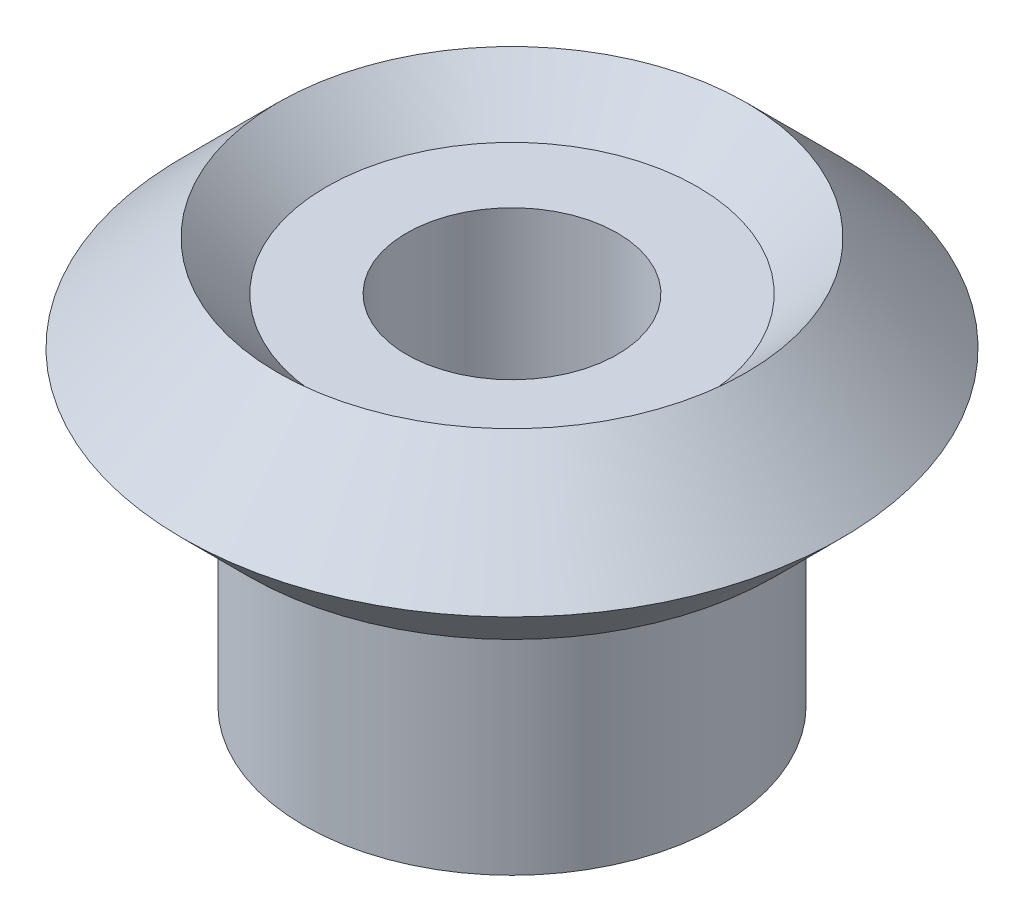
ISO-10303-21;
HEADER;
FILE_DESCRIPTION(('STEP AP214'),'2;1');
FILE_NAME('part.step','',(''),(''),'','','');
FILE_SCHEMA(('AUTOMOTIVE_DESIGN { 1 0 10303 214 1 1 1 1 }'));
ENDSEC;
DATA;
#1=APPLICATION_CONTEXT('core data for automotive mechanical design processes');
#2=APPLICATION_PROTOCOL_DEFINITION('international standard','automotive_design',2000,#1);
#3=PRODUCT_CONTEXT('',#1,'mechanical');
#4=PRODUCT('Part','Part','',(#3));
#5=PRODUCT_RELATED_PRODUCT_CATEGORY('part','',(#4));
#6=PRODUCT_DEFINITION_FORMATION('','',#4);
#7=PRODUCT_DEFINITION_CONTEXT('part definition',#1,'design');
#8=PRODUCT_DEFINITION('design','',#6,#7);
#9=PRODUCT_DEFINITION_SHAPE('','',#8);
#10=(LENGTH_UNIT() NAMED_UNIT(*) SI_UNIT(.MILLI.,.METRE.));
#11=(NAMED_UNIT(*) PLANE_ANGLE_UNIT() SI_UNIT($,.RADIAN.));
#12=(NAMED_UNIT(*) SI_UNIT($,.STERADIAN.) SOLID_ANGLE_UNIT());
#13=UNCERTAINTY_MEASURE_WITH_UNIT(LENGTH_MEASURE(1.E-05),#10,'distance_accuracy_value','');
#14=(GEOMETRIC_REPRESENTATION_CONTEXT(3) GLOBAL_UNCERTAINTY_ASSIGNED_CONTEXT((#13)) GLOBAL_UNIT_ASSIGNED_CONTEXT((#10,
#11,#12)) REPRESENTATION_CONTEXT('',''));
#15=CARTESIAN_POINT('',(0.,0.,0.));
#16=DIRECTION('',(0.,0.,1.));
#17=DIRECTION('',(1.,0.,0.));
#18=AXIS2_PLACEMENT_3D('',#15,#16,#17);
#19=CARTESIAN_POINT('',(3.85,0.,0.));
#20=DIRECTION('',(0.,-1.,0.));
#21=DIRECTION('',(0.,0.,-1.));
#22=AXIS2_PLACEMENT_3D('',#19,#20,#21);
#23=PLANE('',#22);
#24=CARTESIAN_POINT('',(0.,0.,0.));
#25=DIRECTION('',(0.,-1.,0.));
#26=DIRECTION('',(0.,0.,-1.));
#27=AXIS2_PLACEMENT_3D('',#24,#25,#26);
#28=CIRCLE('',#27,3.85);
#29=CARTESIAN_POINT('',(0.,0.,-3.85));
#30=VERTEX_POINT('',#29);
#31=EDGE_CURVE('E56',#30,#30,#28,.T.);
#32=ORIENTED_EDGE('',*,*,#31,.T.);
#33=EDGE_LOOP('',(#32));
#34=FACE_BOUND('',#33,.T.);
#35=CARTESIAN_POINT('',(0.,0.,0.));
#36=DIRECTION('',(0.,-1.,0.));
#37=DIRECTION('',(0.,0.,-1.));
#38=AXIS2_PLACEMENT_3D('',#35,#36,#37);
#39=CIRCLE('',#38,1.95);
#40=CARTESIAN_POINT('',(0.,0.,-1.95));
#41=VERTEX_POINT('',#40);
#42=EDGE_CURVE('E10',#41,#41,#39,.T.);
#43=ORIENTED_EDGE('',*,*,#42,.F.);
#44=EDGE_LOOP('',(#43));
#45=FACE_BOUND('',#44,.T.);
#46=ADVANCED_FACE('F28',(#34,#45),#23,.T.);
#47=CARTESIAN_POINT('',(0.,0.,0.));
#48=DIRECTION('',(0.,-1.,0.));
#49=DIRECTION('',(0.,0.,-1.));
#50=AXIS2_PLACEMENT_3D('',#47,#48,#49);
#51=CYLINDRICAL_SURFACE('',#50,1.95);
#52=ORIENTED_EDGE('',*,*,#42,.T.);
#53=EDGE_LOOP('',(#52));
#54=FACE_BOUND('',#53,.T.);
#55=CARTESIAN_POINT('',(0.,6.6,0.));
#56=DIRECTION('',(0.,-1.,0.));
#57=DIRECTION('',(0.,0.,-1.));
#58=AXIS2_PLACEMENT_3D('',#55,#56,#57);
#59=CIRCLE('',#58,1.95);
#60=CARTESIAN_POINT('',(0.,6.6,-1.95));
#61=VERTEX_POINT('',#60);
#62=EDGE_CURVE('E34',#61,#61,#59,.T.);
#63=ORIENTED_EDGE('',*,*,#62,.F.);
#64=EDGE_LOOP('',(#63));
#65=FACE_BOUND('',#64,.T.);
#66=ADVANCED_FACE('F74',(#54,#65),#51,.F.);
#67=CARTESIAN_POINT('',(1.95,6.6,0.));
#68=DIRECTION('',(0.,1.,0.));
#69=DIRECTION('',(0.,0.,1.));
#70=AXIS2_PLACEMENT_3D('',#67,#68,#69);
#71=PLANE('',#70);
#72=ORIENTED_EDGE('',*,*,#62,.T.);
#73=EDGE_LOOP('',(#72));
#74=FACE_BOUND('',#73,.T.);
#75=CARTESIAN_POINT('',(0.,6.6,0.));
#76=DIRECTION('',(0.,-1.,0.));
#77=DIRECTION('',(0.,0.,-1.));
#78=AXIS2_PLACEMENT_3D('',#75,#76,#77);
#79=CIRCLE('',#78,3.43223304703363);
#80=CARTESIAN_POINT('',(0.,6.6,-3.43223304703363));
#81=VERTEX_POINT('',#80);
#82=EDGE_CURVE('E38',#81,#81,#79,.T.);
#83=ORIENTED_EDGE('',*,*,#82,.F.);
#84=EDGE_LOOP('',(#83));
#85=FACE_BOUND('',#84,.T.);
#86=ADVANCED_FACE('F78',(#74,#85),#71,.T.);
#87=CARTESIAN_POINT('',(0.,7.5,0.));
#88=DIRECTION('',(0.,1.,0.));
#89=DIRECTION('',(0.,0.,1.));
#90=AXIS2_PLACEMENT_3D('',#87,#88,#89);
#91=CONICAL_SURFACE('',#90,4.33223304703365,0.785398163397458);
#92=ORIENTED_EDGE('',*,*,#82,.T.);
#93=EDGE_LOOP('',(#92));
#94=FACE_BOUND('',#93,.T.);
#95=CARTESIAN_POINT('',(0.,7.5,0.));
#96=DIRECTION('',(0.,-1.,0.));
#97=DIRECTION('',(0.,0.,-1.));
#98=AXIS2_PLACEMENT_3D('',#95,#96,#97);
#99=CIRCLE('',#98,4.33223304703365);
#100=CARTESIAN_POINT('',(0.,7.5,-4.33223304703365));
#101=VERTEX_POINT('',#100);
#102=EDGE_CURVE('E42',#101,#101,#99,.T.);
#103=ORIENTED_EDGE('',*,*,#102,.F.);
#104=EDGE_LOOP('',(#103));
#105=FACE_BOUND('',#104,.T.);
#106=ADVANCED_FACE('F82',(#94,#105),#91,.F.);
#107=CARTESIAN_POINT('',(0.,5.73223304703362,0.));
#108=DIRECTION('',(0.,-1.,0.));
#109=DIRECTION('',(0.,0.,-1.));
#110=AXIS2_PLACEMENT_3D('',#107,#108,#109);
#111=CONICAL_SURFACE('',#110,6.10000000000001,0.785398163397443);
#112=ORIENTED_EDGE('',*,*,#102,.T.);
#113=EDGE_LOOP('',(#112));
#114=FACE_BOUND('',#113,.T.);
#115=CARTESIAN_POINT('',(0.,5.73223304703362,0.));
#116=DIRECTION('',(0.,-1.,0.));
#117=DIRECTION('',(0.,0.,-1.));
#118=AXIS2_PLACEMENT_3D('',#115,#116,#117);
#119=CIRCLE('',#118,6.10000000000001);
#120=CARTESIAN_POINT('',(0.,5.73223304703362,-6.10000000000001));
#121=VERTEX_POINT('',#120);
#122=EDGE_CURVE('E47',#121,#121,#119,.T.);
#123=ORIENTED_EDGE('',*,*,#122,.F.);
#124=EDGE_LOOP('',(#123));
#125=FACE_BOUND('',#124,.T.);
#126=ADVANCED_FACE('F88',(#114,#125),#111,.T.);
#127=CARTESIAN_POINT('',(0.,4.5,0.));
#128=DIRECTION('',(0.,1.,0.));
#129=DIRECTION('',(0.,0.,1.));
#130=AXIS2_PLACEMENT_3D('',#127,#128,#129);
#131=CONICAL_SURFACE('',#130,4.86776695296636,0.785398163397457);
#132=ORIENTED_EDGE('',*,*,#122,.T.);
#133=EDGE_LOOP('',(#132));
#134=FACE_BOUND('',#133,.T.);
#135=CARTESIAN_POINT('',(0.,4.5,0.));
#136=DIRECTION('',(0.,-1.,0.));
#137=DIRECTION('',(0.,0.,-1.));
#138=AXIS2_PLACEMENT_3D('',#135,#136,#137);
#139=CIRCLE('',#138,4.86776695296636);
#140=CARTESIAN_POINT('',(0.,4.5,-4.86776695296636));
#141=VERTEX_POINT('',#140);
#142=EDGE_CURVE('E50',#141,#141,#139,.T.);
#143=ORIENTED_EDGE('',*,*,#142,.F.);
#144=EDGE_LOOP('',(#143));
#145=FACE_BOUND('',#144,.T.);
#146=ADVANCED_FACE('F70',(#134,#145),#131,.T.);
#147=CARTESIAN_POINT('',(4.86776695296636,4.5,0.));
#148=DIRECTION('',(0.,-1.,0.));
#149=DIRECTION('',(0.,0.,-1.));
#150=AXIS2_PLACEMENT_3D('',#147,#148,#149);
#151=PLANE('',#150);
#152=ORIENTED_EDGE('',*,*,#142,.T.);
#153=EDGE_LOOP('',(#152));
#154=FACE_BOUND('',#153,.T.);
#155=CARTESIAN_POINT('',(0.,4.5,0.));
#156=DIRECTION('',(0.,-1.,0.));
#157=DIRECTION('',(0.,0.,-1.));
#158=AXIS2_PLACEMENT_3D('',#155,#156,#157);
#159=CIRCLE('',#158,3.85);
#160=CARTESIAN_POINT('',(0.,4.5,-3.85));
#161=VERTEX_POINT('',#160);
#162=EDGE_CURVE('E53',#161,#161,#159,.T.);
#163=ORIENTED_EDGE('',*,*,#162,.F.);
#164=EDGE_LOOP('',(#163));
#165=FACE_BOUND('',#164,.T.);
#166=ADVANCED_FACE('F64',(#154,#165),#151,.T.);
#167=CARTESIAN_POINT('',(0.,0.,0.));
#168=DIRECTION('',(0.,-1.,0.));
#169=DIRECTION('',(0.,0.,-1.));
#170=AXIS2_PLACEMENT_3D('',#167,#168,#169);
#171=CYLINDRICAL_SURFACE('',#170,3.85);
#172=ORIENTED_EDGE('',*,*,#162,.T.);
#173=EDGE_LOOP('',(#172));
#174=FACE_BOUND('',#173,.T.);
#175=ORIENTED_EDGE('',*,*,#31,.F.);
#176=EDGE_LOOP('',(#175));
#177=FACE_BOUND('',#176,.T.);
#178=ADVANCED_FACE('F62',(#174,#177),#171,.T.);
#179=CLOSED_SHELL('',(#46,#66,#86,#106,#126,#146,#166,#178));
#180=MANIFOLD_SOLID_BREP('B2',#179);
#181=ADVANCED_BREP_SHAPE_REPRESENTATION('',(#18,#180),#14);
#182=SHAPE_DEFINITION_REPRESENTATION(#9,#181);
ENDSEC;
END-ISO-10303-21;
